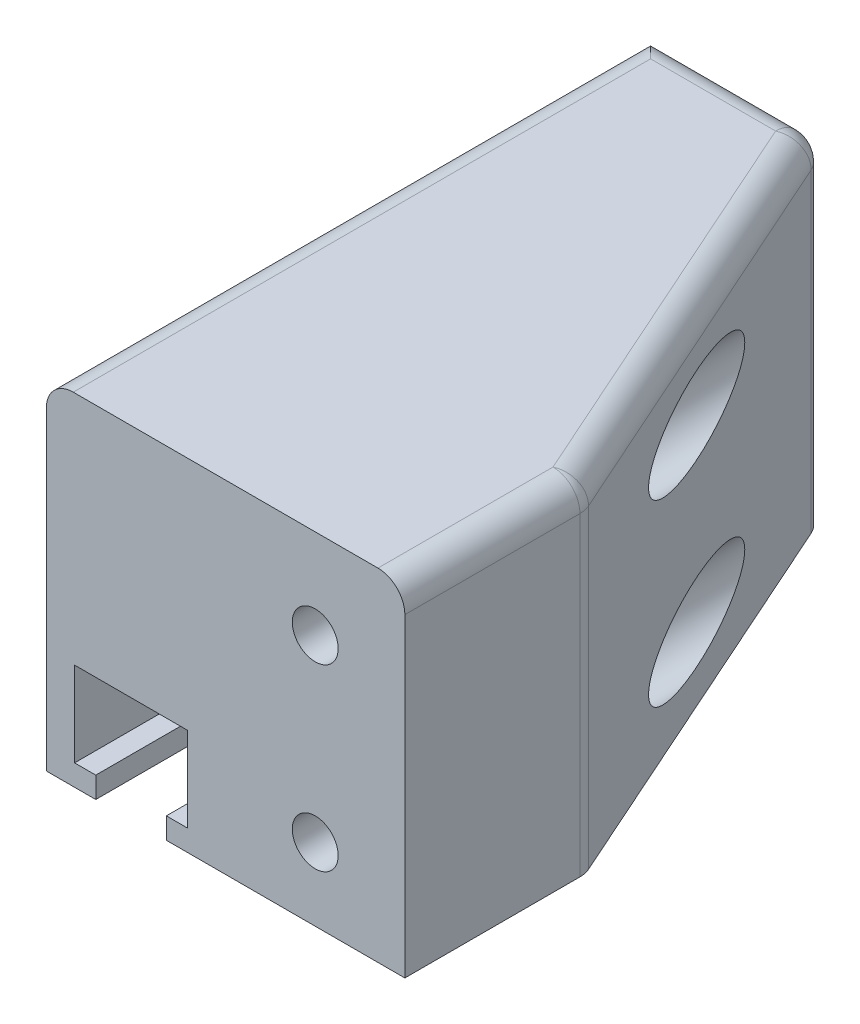
ISO-10303-21;
HEADER;
FILE_DESCRIPTION(('STEP AP214'),'2;1');
FILE_NAME('part.step','',(''),(''),'','','');
FILE_SCHEMA(('AUTOMOTIVE_DESIGN { 1 0 10303 214 1 1 1 1 }'));
ENDSEC;
DATA;
#1=APPLICATION_CONTEXT('core data for automotive mechanical design processes');
#2=APPLICATION_PROTOCOL_DEFINITION('international standard','automotive_design',2000,#1);
#3=PRODUCT_CONTEXT('',#1,'mechanical');
#4=PRODUCT('Part','Part','',(#3));
#5=PRODUCT_RELATED_PRODUCT_CATEGORY('part','',(#4));
#6=PRODUCT_DEFINITION_FORMATION('','',#4);
#7=PRODUCT_DEFINITION_CONTEXT('part definition',#1,'design');
#8=PRODUCT_DEFINITION('design','',#6,#7);
#9=PRODUCT_DEFINITION_SHAPE('','',#8);
#10=(LENGTH_UNIT() NAMED_UNIT(*) SI_UNIT(.MILLI.,.METRE.));
#11=(NAMED_UNIT(*) PLANE_ANGLE_UNIT() SI_UNIT($,.RADIAN.));
#12=(NAMED_UNIT(*) SI_UNIT($,.STERADIAN.) SOLID_ANGLE_UNIT());
#13=UNCERTAINTY_MEASURE_WITH_UNIT(LENGTH_MEASURE(1.E-05),#10,'distance_accuracy_value','');
#14=(GEOMETRIC_REPRESENTATION_CONTEXT(3) GLOBAL_UNCERTAINTY_ASSIGNED_CONTEXT((#13)) GLOBAL_UNIT_ASSIGNED_CONTEXT((#10,
#11,#12)) REPRESENTATION_CONTEXT('',''));
#15=CARTESIAN_POINT('',(0.,0.,0.));
#16=DIRECTION('',(0.,0.,1.));
#17=DIRECTION('',(1.,0.,0.));
#18=AXIS2_PLACEMENT_3D('',#15,#16,#17);
#19=CARTESIAN_POINT('',(-41.8,40.8867513459481,-40.6));
#20=DIRECTION('',(0.,-0.866025403784439,0.5));
#21=DIRECTION('',(0.,0.5,0.866025403784439));
#22=AXIS2_PLACEMENT_3D('',#19,#20,#21);
#23=PLANE('',#22);
#24=DIRECTION('',(1.,0.,0.));
#25=VECTOR('',#24,1.);
#26=CARTESIAN_POINT('',(-41.8,40.8867513459481,-40.6));
#27=LINE('',#26,#25);
#28=CARTESIAN_POINT('',(-41.8,40.8867513459481,-40.6));
#29=VERTEX_POINT('',#28);
#30=CARTESIAN_POINT('',(-35.8,40.8867513459481,-40.6));
#31=VERTEX_POINT('',#30);
#32=EDGE_CURVE('E240',#29,#31,#27,.T.);
#33=ORIENTED_EDGE('',*,*,#32,.T.);
#34=DIRECTION('',(0.,0.5,0.866025403784439));
#35=VECTOR('',#34,1.);
#36=CARTESIAN_POINT('',(-35.8,40.8867513459481,-40.6));
#37=LINE('',#36,#35);
#38=CARTESIAN_POINT('',(-35.8,43.7735026918962,-35.6));
#39=VERTEX_POINT('',#38);
#40=EDGE_CURVE('E222',#31,#39,#37,.T.);
#41=ORIENTED_EDGE('',*,*,#40,.T.);
#42=DIRECTION('',(1.,0.,0.));
#43=VECTOR('',#42,1.);
#44=CARTESIAN_POINT('',(-41.8,43.7735026918962,-35.6));
#45=LINE('',#44,#43);
#46=CARTESIAN_POINT('',(-41.8,43.7735026918962,-35.6));
#47=VERTEX_POINT('',#46);
#48=EDGE_CURVE('E245',#47,#39,#45,.T.);
#49=ORIENTED_EDGE('',*,*,#48,.F.);
#50=DIRECTION('',(0.,0.5,0.866025403784439));
#51=VECTOR('',#50,1.);
#52=CARTESIAN_POINT('',(-41.8,40.8867513459481,-40.6));
#53=LINE('',#52,#51);
#54=EDGE_CURVE('E224',#29,#47,#53,.T.);
#55=ORIENTED_EDGE('',*,*,#54,.F.);
#56=EDGE_LOOP('',(#33,#41,#49,#55));
#57=FACE_BOUND('',#56,.T.);
#58=ADVANCED_FACE('F45',(#57),#23,.T.);
#59=CARTESIAN_POINT('',(-41.8,43.7735026918962,-35.6));
#60=DIRECTION('',(0.,-0.866025403784439,-0.5));
#61=DIRECTION('',(0.,-0.5,0.866025403784439));
#62=AXIS2_PLACEMENT_3D('',#59,#60,#61);
#63=PLANE('',#62);
#64=ORIENTED_EDGE('',*,*,#48,.T.);
#65=DIRECTION('',(0.,-0.5,0.866025403784439));
#66=VECTOR('',#65,1.);
#67=CARTESIAN_POINT('',(-35.8,43.7735026918962,-35.6));
#68=LINE('',#67,#66);
#69=CARTESIAN_POINT('',(-35.8,40.8867513459481,-30.6));
#70=VERTEX_POINT('',#69);
#71=EDGE_CURVE('E230',#39,#70,#68,.T.);
#72=ORIENTED_EDGE('',*,*,#71,.T.);
#73=DIRECTION('',(1.,0.,0.));
#74=VECTOR('',#73,1.);
#75=CARTESIAN_POINT('',(-41.8,40.8867513459481,-30.6));
#76=LINE('',#75,#74);
#77=CARTESIAN_POINT('',(-41.8,40.8867513459481,-30.6));
#78=VERTEX_POINT('',#77);
#79=EDGE_CURVE('E242',#78,#70,#76,.T.);
#80=ORIENTED_EDGE('',*,*,#79,.F.);
#81=DIRECTION('',(0.,-0.5,0.866025403784439));
#82=VECTOR('',#81,1.);
#83=CARTESIAN_POINT('',(-41.8,43.7735026918962,-35.6));
#84=LINE('',#83,#82);
#85=EDGE_CURVE('E228',#47,#78,#84,.T.);
#86=ORIENTED_EDGE('',*,*,#85,.F.);
#87=EDGE_LOOP('',(#64,#72,#80,#86));
#88=FACE_BOUND('',#87,.T.);
#89=ADVANCED_FACE('F416',(#88),#63,.T.);
#90=CARTESIAN_POINT('',(-41.8,40.8867513459481,-30.6));
#91=DIRECTION('',(0.,0.,-1.));
#92=DIRECTION('',(1.,0.,0.));
#93=AXIS2_PLACEMENT_3D('',#90,#91,#92);
#94=PLANE('',#93);
#95=ORIENTED_EDGE('',*,*,#79,.T.);
#96=DIRECTION('',(0.,-1.,0.));
#97=VECTOR('',#96,1.);
#98=CARTESIAN_POINT('',(-35.8,40.8867513459481,-30.6));
#99=LINE('',#98,#97);
#100=CARTESIAN_POINT('',(-35.8,15.,-30.6));
#101=VERTEX_POINT('',#100);
#102=EDGE_CURVE('E225',#70,#101,#99,.T.);
#103=ORIENTED_EDGE('',*,*,#102,.T.);
#104=DIRECTION('',(1.,0.,0.));
#105=VECTOR('',#104,1.);
#106=CARTESIAN_POINT('',(-41.8,15.,-30.6));
#107=LINE('',#106,#105);
#108=CARTESIAN_POINT('',(-41.8,15.,-30.6));
#109=VERTEX_POINT('',#108);
#110=EDGE_CURVE('E206',#109,#101,#107,.T.);
#111=ORIENTED_EDGE('',*,*,#110,.F.);
#112=DIRECTION('',(0.,-1.,0.));
#113=VECTOR('',#112,1.);
#114=CARTESIAN_POINT('',(-41.8,40.8867513459481,-30.6));
#115=LINE('',#114,#113);
#116=EDGE_CURVE('E236',#78,#109,#115,.T.);
#117=ORIENTED_EDGE('',*,*,#116,.F.);
#118=EDGE_LOOP('',(#95,#103,#111,#117));
#119=FACE_BOUND('',#118,.T.);
#120=ADVANCED_FACE('F419',(#119),#94,.T.);
#121=CARTESIAN_POINT('',(-41.8,35.1132486540519,-40.6));
#122=DIRECTION('',(0.,0.,1.));
#123=DIRECTION('',(-1.,0.,0.));
#124=AXIS2_PLACEMENT_3D('',#121,#122,#123);
#125=PLANE('',#124);
#126=DIRECTION('',(0.,1.,0.));
#127=VECTOR('',#126,1.);
#128=CARTESIAN_POINT('',(-35.8,35.1132486540519,-40.6));
#129=LINE('',#128,#127);
#130=CARTESIAN_POINT('',(-35.8,15.,-40.6));
#131=VERTEX_POINT('',#130);
#132=EDGE_CURVE('E215',#131,#31,#129,.T.);
#133=ORIENTED_EDGE('',*,*,#132,.T.);
#134=ORIENTED_EDGE('',*,*,#32,.F.);
#135=DIRECTION('',(0.,1.,0.));
#136=VECTOR('',#135,1.);
#137=CARTESIAN_POINT('',(-41.8,35.1132486540519,-40.6));
#138=LINE('',#137,#136);
#139=CARTESIAN_POINT('',(-41.8,15.,-40.6));
#140=VERTEX_POINT('',#139);
#141=EDGE_CURVE('E217',#140,#29,#138,.T.);
#142=ORIENTED_EDGE('',*,*,#141,.F.);
#143=DIRECTION('',(-1.,0.,0.));
#144=VECTOR('',#143,1.);
#145=CARTESIAN_POINT('',(-41.8,15.,-40.6));
#146=LINE('',#145,#144);
#147=EDGE_CURVE('E203',#131,#140,#146,.T.);
#148=ORIENTED_EDGE('',*,*,#147,.F.);
#149=EDGE_LOOP('',(#133,#134,#142,#148));
#150=FACE_BOUND('',#149,.T.);
#151=ADVANCED_FACE('F213',(#150),#125,.T.);
#152=CARTESIAN_POINT('',(-41.8,0.,0.));
#153=DIRECTION('',(-1.,0.,0.));
#154=DIRECTION('',(0.,0.,-1.));
#155=AXIS2_PLACEMENT_3D('',#152,#153,#154);
#156=PLANE('',#155);
#157=CARTESIAN_POINT('',(-41.8,38.,-35.6));
#158=DIRECTION('',(1.,0.,0.));
#159=DIRECTION('',(0.,0.,-1.));
#160=AXIS2_PLACEMENT_3D('',#157,#158,#159);
#161=CIRCLE('',#160,3.25);
#162=CARTESIAN_POINT('',(-41.8,38.,-38.85));
#163=VERTEX_POINT('',#162);
#164=EDGE_CURVE('E210',#163,#163,#161,.F.);
#165=ORIENTED_EDGE('',*,*,#164,.T.);
#166=EDGE_LOOP('',(#165));
#167=FACE_BOUND('',#166,.T.);
#168=ORIENTED_EDGE('',*,*,#141,.T.);
#169=ORIENTED_EDGE('',*,*,#54,.T.);
#170=ORIENTED_EDGE('',*,*,#85,.T.);
#171=ORIENTED_EDGE('',*,*,#116,.T.);
#172=DIRECTION('',(0.,0.,1.));
#173=VECTOR('',#172,1.);
#174=CARTESIAN_POINT('',(-41.8,15.,-40.6));
#175=LINE('',#174,#173);
#176=EDGE_CURVE('E218',#140,#109,#175,.T.);
#177=ORIENTED_EDGE('',*,*,#176,.F.);
#178=EDGE_LOOP('',(#168,#169,#170,#171,#177));
#179=FACE_BOUND('',#178,.T.);
#180=ADVANCED_FACE('F421',(#167,#179),#156,.F.);
#181=CARTESIAN_POINT('',(-35.8,0.,0.));
#182=DIRECTION('',(-1.,0.,0.));
#183=DIRECTION('',(0.,0.,-1.));
#184=AXIS2_PLACEMENT_3D('',#181,#182,#183);
#185=PLANE('',#184);
#186=DIRECTION('',(0.,0.,-1.));
#187=VECTOR('',#186,1.);
#188=CARTESIAN_POINT('',(-35.8,15.,-40.6));
#189=LINE('',#188,#187);
#190=EDGE_CURVE('E199',#101,#131,#189,.T.);
#191=ORIENTED_EDGE('',*,*,#190,.F.);
#192=ORIENTED_EDGE('',*,*,#102,.F.);
#193=ORIENTED_EDGE('',*,*,#71,.F.);
#194=ORIENTED_EDGE('',*,*,#40,.F.);
#195=ORIENTED_EDGE('',*,*,#132,.F.);
#196=EDGE_LOOP('',(#191,#192,#193,#194,#195));
#197=FACE_BOUND('',#196,.T.);
#198=ADVANCED_FACE('F220',(#197),#185,.T.);
#199=CARTESIAN_POINT('',(0.,0.,-85.62));
#200=DIRECTION('',(0.,1.,0.));
#201=DIRECTION('',(-1.,0.,0.));
#202=AXIS2_PLACEMENT_3D('',#199,#200,#201);
#203=PLANE('',#202);
#204=DIRECTION('',(-0.407832100404226,0.,-0.913056941203492));
#205=VECTOR('',#204,1.);
#206=CARTESIAN_POINT('',(-26.8,0.,-85.62));
#207=LINE('',#206,#205);
#208=CARTESIAN_POINT('',(-0.331253054014699,0.,-26.3616113149583));
#209=VERTEX_POINT('',#208);
#210=CARTESIAN_POINT('',(-25.7922486684679,0.,-83.3638403025401));
#211=VERTEX_POINT('',#210);
#212=EDGE_CURVE('E309',#209,#211,#207,.T.);
#213=ORIENTED_EDGE('',*,*,#212,.F.);
#214=CARTESIAN_POINT('',(-3.81,0.,-24.8077710124182));
#215=DIRECTION('',(0.,-1.,0.));
#216=DIRECTION('',(-1.,0.,0.));
#217=AXIS2_PLACEMENT_3D('',#214,#215,#216);
#218=CIRCLE('',#217,3.81);
#219=CARTESIAN_POINT('',(0.,0.,-24.8077710124182));
#220=VERTEX_POINT('',#219);
#221=EDGE_CURVE('E377',#220,#209,#218,.F.);
#222=ORIENTED_EDGE('',*,*,#221,.F.);
#223=DIRECTION('',(0.,0.,1.));
#224=VECTOR('',#223,1.);
#225=CARTESIAN_POINT('',(0.,0.,-85.62));
#226=LINE('',#225,#224);
#227=CARTESIAN_POINT('',(0.,0.,0.));
#228=VERTEX_POINT('',#227);
#229=EDGE_CURVE('E345',#220,#228,#226,.T.);
#230=ORIENTED_EDGE('',*,*,#229,.T.);
#231=DIRECTION('',(1.,0.,0.));
#232=VECTOR('',#231,1.);
#233=CARTESIAN_POINT('',(0.,0.,0.));
#234=LINE('',#233,#232);
#235=CARTESIAN_POINT('',(-33.8,0.,0.));
#236=VERTEX_POINT('',#235);
#237=EDGE_CURVE('E326',#236,#228,#234,.T.);
#238=ORIENTED_EDGE('',*,*,#237,.F.);
#239=DIRECTION('',(0.,0.,1.));
#240=VECTOR('',#239,1.);
#241=CARTESIAN_POINT('',(-33.8,0.,-70.));
#242=LINE('',#241,#240);
#243=CARTESIAN_POINT('',(-33.8,0.,-70.));
#244=VERTEX_POINT('',#243);
#245=EDGE_CURVE('E306',#244,#236,#242,.T.);
#246=ORIENTED_EDGE('',*,*,#245,.F.);
#247=DIRECTION('',(-1.,0.,0.));
#248=VECTOR('',#247,1.);
#249=CARTESIAN_POINT('',(-43.8,0.,-70.));
#250=LINE('',#249,#248);
#251=CARTESIAN_POINT('',(-43.8,0.,-70.));
#252=VERTEX_POINT('',#251);
#253=EDGE_CURVE('E267',#244,#252,#250,.T.);
#254=ORIENTED_EDGE('',*,*,#253,.T.);
#255=DIRECTION('',(0.,0.,1.));
#256=VECTOR('',#255,1.);
#257=CARTESIAN_POINT('',(-43.8,0.,-70.));
#258=LINE('',#257,#256);
#259=CARTESIAN_POINT('',(-43.8,0.,0.));
#260=VERTEX_POINT('',#259);
#261=EDGE_CURVE('E285',#252,#260,#258,.T.);
#262=ORIENTED_EDGE('',*,*,#261,.T.);
#263=CARTESIAN_POINT('',(-50.8,0.,0.));
#264=VERTEX_POINT('',#263);
#265=EDGE_CURVE('E334',#264,#260,#234,.T.);
#266=ORIENTED_EDGE('',*,*,#265,.F.);
#267=DIRECTION('',(0.,0.,1.));
#268=VECTOR('',#267,1.);
#269=CARTESIAN_POINT('',(-50.8,0.,-85.62));
#270=LINE('',#269,#268);
#271=CARTESIAN_POINT('',(-50.8,0.,-85.62));
#272=VERTEX_POINT('',#271);
#273=EDGE_CURVE('E333',#272,#264,#270,.T.);
#274=ORIENTED_EDGE('',*,*,#273,.F.);
#275=DIRECTION('',(1.,0.,0.));
#276=VECTOR('',#275,1.);
#277=CARTESIAN_POINT('',(0.,0.,-85.62));
#278=LINE('',#277,#276);
#279=CARTESIAN_POINT('',(-29.2709956144532,0.,-85.62));
#280=VERTEX_POINT('',#279);
#281=EDGE_CURVE('E327',#272,#280,#278,.T.);
#282=ORIENTED_EDGE('',*,*,#281,.T.);
#283=CARTESIAN_POINT('',(-29.2709956144532,0.,-81.81));
#284=DIRECTION('',(0.,-1.,0.));
#285=DIRECTION('',(-1.,0.,0.));
#286=AXIS2_PLACEMENT_3D('',#283,#284,#285);
#287=CIRCLE('',#286,3.81);
#288=EDGE_CURVE('E380',#211,#280,#287,.F.);
#289=ORIENTED_EDGE('',*,*,#288,.F.);
#290=EDGE_LOOP('',(#213,#222,#230,#238,#246,#254,#262,#266,#274,#282,#289));
#291=FACE_BOUND('',#290,.T.);
#292=ADVANCED_FACE('F509',(#291),#203,.F.);
#293=CARTESIAN_POINT('',(0.,0.,-85.62));
#294=DIRECTION('',(-1.,0.,0.));
#295=DIRECTION('',(0.,0.,-1.));
#296=AXIS2_PLACEMENT_3D('',#293,#294,#295);
#297=PLANE('',#296);
#298=DIRECTION('',(0.,0.,1.));
#299=VECTOR('',#298,1.);
#300=CARTESIAN_POINT('',(0.,44.59,-85.62));
#301=LINE('',#300,#299);
#302=CARTESIAN_POINT('',(0.,44.59,0.));
#303=VERTEX_POINT('',#302);
#304=CARTESIAN_POINT('',(0.,44.59,-24.8077710124182));
#305=VERTEX_POINT('',#304);
#306=EDGE_CURVE('E383',#303,#305,#301,.F.);
#307=ORIENTED_EDGE('',*,*,#306,.F.);
#308=DIRECTION('',(0.,1.,0.));
#309=VECTOR('',#308,1.);
#310=CARTESIAN_POINT('',(0.,0.,0.));
#311=LINE('',#310,#309);
#312=EDGE_CURVE('E337',#228,#303,#311,.T.);
#313=ORIENTED_EDGE('',*,*,#312,.F.);
#314=ORIENTED_EDGE('',*,*,#229,.F.);
#315=DIRECTION('',(0.,1.,0.));
#316=VECTOR('',#315,1.);
#317=CARTESIAN_POINT('',(0.,0.,-24.8077710124182));
#318=LINE('',#317,#316);
#319=EDGE_CURVE('E386',#305,#220,#318,.F.);
#320=ORIENTED_EDGE('',*,*,#319,.F.);
#321=EDGE_LOOP('',(#307,#313,#314,#320));
#322=FACE_BOUND('',#321,.T.);
#323=ADVANCED_FACE('F505',(#322),#297,.F.);
#324=CARTESIAN_POINT('',(0.,48.4,-85.62));
#325=DIRECTION('',(0.,-1.,0.));
#326=DIRECTION('',(1.,0.,0.));
#327=AXIS2_PLACEMENT_3D('',#324,#325,#326);
#328=PLANE('',#327);
#329=DIRECTION('',(-0.407832100404226,0.,-0.913056941203492));
#330=VECTOR('',#329,1.);
#331=CARTESIAN_POINT('',(-25.821182753166,48.4,-74.0865383702525));
#332=LINE('',#331,#330);
#333=CARTESIAN_POINT('',(-29.2709956144532,48.4,-81.81));
#334=VERTEX_POINT('',#333);
#335=CARTESIAN_POINT('',(-3.81,48.4,-24.8077710124182));
#336=VERTEX_POINT('',#335);
#337=EDGE_CURVE('E364',#334,#336,#332,.F.);
#338=ORIENTED_EDGE('',*,*,#337,.F.);
#339=DIRECTION('',(-1.,0.,0.));
#340=VECTOR('',#339,1.);
#341=CARTESIAN_POINT('',(0.,48.4,-81.81));
#342=LINE('',#341,#340);
#343=CARTESIAN_POINT('',(-46.99,48.4,-81.81));
#344=VERTEX_POINT('',#343);
#345=EDGE_CURVE('E361',#344,#334,#342,.F.);
#346=ORIENTED_EDGE('',*,*,#345,.F.);
#347=DIRECTION('',(0.,0.,1.));
#348=VECTOR('',#347,1.);
#349=CARTESIAN_POINT('',(-46.99,48.4,-85.62));
#350=LINE('',#349,#348);
#351=CARTESIAN_POINT('',(-46.99,48.4,0.));
#352=VERTEX_POINT('',#351);
#353=EDGE_CURVE('E358',#352,#344,#350,.F.);
#354=ORIENTED_EDGE('',*,*,#353,.F.);
#355=DIRECTION('',(-1.,0.,0.));
#356=VECTOR('',#355,1.);
#357=CARTESIAN_POINT('',(0.,48.4,0.));
#358=LINE('',#357,#356);
#359=CARTESIAN_POINT('',(-3.81,48.4,0.));
#360=VERTEX_POINT('',#359);
#361=EDGE_CURVE('E340',#360,#352,#358,.T.);
#362=ORIENTED_EDGE('',*,*,#361,.F.);
#363=DIRECTION('',(0.,0.,1.));
#364=VECTOR('',#363,1.);
#365=CARTESIAN_POINT('',(-3.81,48.4,-85.62));
#366=LINE('',#365,#364);
#367=EDGE_CURVE('E367',#336,#360,#366,.T.);
#368=ORIENTED_EDGE('',*,*,#367,.F.);
#369=EDGE_LOOP('',(#338,#346,#354,#362,#368));
#370=FACE_BOUND('',#369,.T.);
#371=ADVANCED_FACE('F502',(#370),#328,.F.);
#372=CARTESIAN_POINT('',(-50.8,0.,-85.62));
#373=DIRECTION('',(1.,0.,0.));
#374=DIRECTION('',(0.,0.,1.));
#375=AXIS2_PLACEMENT_3D('',#372,#373,#374);
#376=PLANE('',#375);
#377=CARTESIAN_POINT('',(-50.8,38.,-35.6));
#378=DIRECTION('',(1.,0.,0.));
#379=DIRECTION('',(0.,0.,-1.));
#380=AXIS2_PLACEMENT_3D('',#377,#378,#379);
#381=CIRCLE('',#380,3.25);
#382=CARTESIAN_POINT('',(-50.8,38.,-38.85));
#383=VERTEX_POINT('',#382);
#384=EDGE_CURVE('E401',#383,#383,#381,.T.);
#385=ORIENTED_EDGE('',*,*,#384,.T.);
#386=EDGE_LOOP('',(#385));
#387=FACE_BOUND('',#386,.T.);
#388=DIRECTION('',(0.,-1.,0.));
#389=VECTOR('',#388,1.);
#390=CARTESIAN_POINT('',(-50.8,0.,-85.62));
#391=LINE('',#390,#389);
#392=CARTESIAN_POINT('',(-50.8,44.59,-85.62));
#393=VERTEX_POINT('',#392);
#394=EDGE_CURVE('E330',#393,#272,#391,.T.);
#395=ORIENTED_EDGE('',*,*,#394,.T.);
#396=ORIENTED_EDGE('',*,*,#273,.T.);
#397=DIRECTION('',(0.,-1.,0.));
#398=VECTOR('',#397,1.);
#399=CARTESIAN_POINT('',(-50.8,0.,0.));
#400=LINE('',#399,#398);
#401=CARTESIAN_POINT('',(-50.8,44.59,0.));
#402=VERTEX_POINT('',#401);
#403=EDGE_CURVE('E331',#402,#264,#400,.T.);
#404=ORIENTED_EDGE('',*,*,#403,.F.);
#405=DIRECTION('',(0.,0.,1.));
#406=VECTOR('',#405,1.);
#407=CARTESIAN_POINT('',(-50.8,44.59,-85.62));
#408=LINE('',#407,#406);
#409=EDGE_CURVE('E11',#393,#402,#408,.T.);
#410=ORIENTED_EDGE('',*,*,#409,.F.);
#411=EDGE_LOOP('',(#395,#396,#404,#410));
#412=FACE_BOUND('',#411,.T.);
#413=ADVANCED_FACE('F495',(#387,#412),#376,.F.);
#414=CARTESIAN_POINT('',(0.,0.,-85.62));
#415=DIRECTION('',(0.,0.,1.));
#416=DIRECTION('',(-1.,0.,0.));
#417=AXIS2_PLACEMENT_3D('',#414,#415,#416);
#418=PLANE('',#417);
#419=DIRECTION('',(0.,1.,0.));
#420=VECTOR('',#419,1.);
#421=CARTESIAN_POINT('',(-29.2709956144532,0.,-85.62));
#422=LINE('',#421,#420);
#423=CARTESIAN_POINT('',(-29.2709956144532,44.59,-85.62));
#424=VERTEX_POINT('',#423);
#425=EDGE_CURVE('E348',#280,#424,#422,.T.);
#426=ORIENTED_EDGE('',*,*,#425,.F.);
#427=ORIENTED_EDGE('',*,*,#281,.F.);
#428=ORIENTED_EDGE('',*,*,#394,.F.);
#429=DIRECTION('',(-1.,0.,0.));
#430=VECTOR('',#429,1.);
#431=CARTESIAN_POINT('',(0.,44.59,-85.62));
#432=LINE('',#431,#430);
#433=EDGE_CURVE('E355',#424,#393,#432,.T.);
#434=ORIENTED_EDGE('',*,*,#433,.F.);
#435=EDGE_LOOP('',(#426,#427,#428,#434));
#436=FACE_BOUND('',#435,.T.);
#437=ADVANCED_FACE('F492',(#436),#418,.F.);
#438=CARTESIAN_POINT('',(0.,0.,0.));
#439=DIRECTION('',(0.,0.,1.));
#440=DIRECTION('',(-1.,0.,0.));
#441=AXIS2_PLACEMENT_3D('',#438,#439,#440);
#442=PLANE('',#441);
#443=CARTESIAN_POINT('',(-12.7,35.7,0.));
#444=DIRECTION('',(0.,0.,1.));
#445=DIRECTION('',(1.,0.,0.));
#446=AXIS2_PLACEMENT_3D('',#443,#444,#445);
#447=CIRCLE('',#446,3.25);
#448=CARTESIAN_POINT('',(-9.45,35.7,0.));
#449=VERTEX_POINT('',#448);
#450=EDGE_CURVE('E249',#449,#449,#447,.T.);
#451=ORIENTED_EDGE('',*,*,#450,.F.);
#452=EDGE_LOOP('',(#451));
#453=FACE_BOUND('',#452,.T.);
#454=CARTESIAN_POINT('',(-12.7,10.3,0.));
#455=DIRECTION('',(0.,0.,1.));
#456=DIRECTION('',(1.,0.,0.));
#457=AXIS2_PLACEMENT_3D('',#454,#455,#456);
#458=CIRCLE('',#457,3.25);
#459=CARTESIAN_POINT('',(-9.45,10.3,0.));
#460=VERTEX_POINT('',#459);
#461=EDGE_CURVE('E248',#460,#460,#458,.T.);
#462=ORIENTED_EDGE('',*,*,#461,.F.);
#463=EDGE_LOOP('',(#462));
#464=FACE_BOUND('',#463,.T.);
#465=ORIENTED_EDGE('',*,*,#361,.T.);
#466=CARTESIAN_POINT('',(-46.99,44.59,0.));
#467=DIRECTION('',(0.,0.,-1.));
#468=DIRECTION('',(-1.,0.,0.));
#469=AXIS2_PLACEMENT_3D('',#466,#467,#468);
#470=CIRCLE('',#469,3.81);
#471=EDGE_CURVE('E62',#402,#352,#470,.T.);
#472=ORIENTED_EDGE('',*,*,#471,.F.);
#473=ORIENTED_EDGE('',*,*,#403,.T.);
#474=ORIENTED_EDGE('',*,*,#265,.T.);
#475=DIRECTION('',(0.,1.,0.));
#476=VECTOR('',#475,1.);
#477=CARTESIAN_POINT('',(-43.8,0.,0.));
#478=LINE('',#477,#476);
#479=CARTESIAN_POINT('',(-43.8,2.99999999999999,0.));
#480=VERTEX_POINT('',#479);
#481=EDGE_CURVE('E286',#260,#480,#478,.T.);
#482=ORIENTED_EDGE('',*,*,#481,.T.);
#483=DIRECTION('',(-1.,0.,0.));
#484=VECTOR('',#483,1.);
#485=CARTESIAN_POINT('',(-43.8,2.99999999999999,0.));
#486=LINE('',#485,#484);
#487=CARTESIAN_POINT('',(-46.8,2.99999999999999,0.));
#488=VERTEX_POINT('',#487);
#489=EDGE_CURVE('E289',#480,#488,#486,.T.);
#490=ORIENTED_EDGE('',*,*,#489,.T.);
#491=DIRECTION('',(0.,1.,0.));
#492=VECTOR('',#491,1.);
#493=CARTESIAN_POINT('',(-46.8,2.99999999999999,0.));
#494=LINE('',#493,#492);
#495=CARTESIAN_POINT('',(-46.8,15.,0.));
#496=VERTEX_POINT('',#495);
#497=EDGE_CURVE('E293',#488,#496,#494,.T.);
#498=ORIENTED_EDGE('',*,*,#497,.T.);
#499=DIRECTION('',(1.,0.,0.));
#500=VECTOR('',#499,1.);
#501=CARTESIAN_POINT('',(-46.8,15.,0.));
#502=LINE('',#501,#500);
#503=CARTESIAN_POINT('',(-30.8,15.,0.));
#504=VERTEX_POINT('',#503);
#505=EDGE_CURVE('E296',#496,#504,#502,.T.);
#506=ORIENTED_EDGE('',*,*,#505,.T.);
#507=DIRECTION('',(0.,-1.,0.));
#508=VECTOR('',#507,1.);
#509=CARTESIAN_POINT('',(-30.8,15.,0.));
#510=LINE('',#509,#508);
#511=CARTESIAN_POINT('',(-30.8,2.99999999999999,0.));
#512=VERTEX_POINT('',#511);
#513=EDGE_CURVE('E299',#504,#512,#510,.T.);
#514=ORIENTED_EDGE('',*,*,#513,.T.);
#515=DIRECTION('',(-1.,0.,0.));
#516=VECTOR('',#515,1.);
#517=CARTESIAN_POINT('',(-30.8,2.99999999999999,0.));
#518=LINE('',#517,#516);
#519=CARTESIAN_POINT('',(-33.8,2.99999999999999,0.));
#520=VERTEX_POINT('',#519);
#521=EDGE_CURVE('E302',#512,#520,#518,.T.);
#522=ORIENTED_EDGE('',*,*,#521,.T.);
#523=DIRECTION('',(0.,-1.,0.));
#524=VECTOR('',#523,1.);
#525=CARTESIAN_POINT('',(-33.8,2.99999999999999,0.));
#526=LINE('',#525,#524);
#527=EDGE_CURVE('E271',#520,#236,#526,.T.);
#528=ORIENTED_EDGE('',*,*,#527,.T.);
#529=ORIENTED_EDGE('',*,*,#237,.T.);
#530=ORIENTED_EDGE('',*,*,#312,.T.);
#531=CARTESIAN_POINT('',(-3.81,44.59,0.));
#532=DIRECTION('',(0.,0.,-1.));
#533=DIRECTION('',(-1.,0.,0.));
#534=AXIS2_PLACEMENT_3D('',#531,#532,#533);
#535=CIRCLE('',#534,3.81);
#536=EDGE_CURVE('E54',#360,#303,#535,.T.);
#537=ORIENTED_EDGE('',*,*,#536,.F.);
#538=EDGE_LOOP('',(#465,#472,#473,#474,#482,#490,#498,#506,#514,#522,#528,#529,#530,#537));
#539=FACE_BOUND('',#538,.T.);
#540=ADVANCED_FACE('F490',(#453,#464,#539),#442,.T.);
#541=CARTESIAN_POINT('',(-26.8,0.,-85.62));
#542=DIRECTION('',(-0.913056941203492,0.,0.407832100404226));
#543=DIRECTION('',(-0.407832100404226,0.,-0.913056941203492));
#544=AXIS2_PLACEMENT_3D('',#541,#542,#543);
#545=PLANE('',#544);
#546=CARTESIAN_POINT('',(-12.7,10.3,-54.0528358208955));
#547=DIRECTION('',(0.913056941203492,0.,-0.407832100404226));
#548=DIRECTION('',(-0.407832100404226,0.,-0.913056941203492));
#549=AXIS2_PLACEMENT_3D('',#546,#547,#548);
#550=ELLIPSE('',#549,13.4859418730125,5.5);
#551=CARTESIAN_POINT('',(-18.2,10.3,-66.3662686567164));
#552=VERTEX_POINT('',#551);
#553=EDGE_CURVE('E290',#552,#552,#550,.T.);
#554=ORIENTED_EDGE('',*,*,#553,.F.);
#555=EDGE_LOOP('',(#554));
#556=FACE_BOUND('',#555,.T.);
#557=CARTESIAN_POINT('',(-12.7,35.7,-54.0528358208955));
#558=DIRECTION('',(0.913056941203492,0.,-0.407832100404226));
#559=DIRECTION('',(-0.407832100404226,0.,-0.913056941203492));
#560=AXIS2_PLACEMENT_3D('',#557,#558,#559);
#561=ELLIPSE('',#560,13.4859418730125,5.5);
#562=CARTESIAN_POINT('',(-18.2,35.7,-66.3662686567164));
#563=VERTEX_POINT('',#562);
#564=EDGE_CURVE('E264',#563,#563,#561,.T.);
#565=ORIENTED_EDGE('',*,*,#564,.F.);
#566=EDGE_LOOP('',(#565));
#567=FACE_BOUND('',#566,.T.);
#568=DIRECTION('',(-0.407832100404226,0.,-0.913056941203492));
#569=VECTOR('',#568,1.);
#570=CARTESIAN_POINT('',(-26.8,44.59,-85.62));
#571=LINE('',#570,#569);
#572=CARTESIAN_POINT('',(-0.331253054014696,44.59,-26.3616113149583));
#573=VERTEX_POINT('',#572);
#574=CARTESIAN_POINT('',(-25.7922486684679,44.59,-83.3638403025401));
#575=VERTEX_POINT('',#574);
#576=EDGE_CURVE('E370',#573,#575,#571,.T.);
#577=ORIENTED_EDGE('',*,*,#576,.F.);
#578=DIRECTION('',(0.,1.,0.));
#579=VECTOR('',#578,1.);
#580=CARTESIAN_POINT('',(-0.331253054014689,0.,-26.3616113149583));
#581=LINE('',#580,#579);
#582=EDGE_CURVE('E373',#209,#573,#581,.T.);
#583=ORIENTED_EDGE('',*,*,#582,.F.);
#584=ORIENTED_EDGE('',*,*,#212,.T.);
#585=DIRECTION('',(0.,1.,0.));
#586=VECTOR('',#585,1.);
#587=CARTESIAN_POINT('',(-25.7922486684679,0.,-83.3638403025401));
#588=LINE('',#587,#586);
#589=EDGE_CURVE('E375',#575,#211,#588,.F.);
#590=ORIENTED_EDGE('',*,*,#589,.F.);
#591=EDGE_LOOP('',(#577,#583,#584,#590));
#592=FACE_BOUND('',#591,.T.);
#593=ADVANCED_FACE('F466',(#556,#567,#592),#545,.F.);
#594=CARTESIAN_POINT('',(-33.8,2.99999999999999,-70.));
#595=DIRECTION('',(1.,0.,0.));
#596=DIRECTION('',(0.,0.,1.));
#597=AXIS2_PLACEMENT_3D('',#594,#595,#596);
#598=PLANE('',#597);
#599=ORIENTED_EDGE('',*,*,#527,.F.);
#600=DIRECTION('',(0.,0.,1.));
#601=VECTOR('',#600,1.);
#602=CARTESIAN_POINT('',(-33.8,2.99999999999999,-70.));
#603=LINE('',#602,#601);
#604=CARTESIAN_POINT('',(-33.8,2.99999999999999,-70.));
#605=VERTEX_POINT('',#604);
#606=EDGE_CURVE('E310',#605,#520,#603,.T.);
#607=ORIENTED_EDGE('',*,*,#606,.F.);
#608=DIRECTION('',(0.,-1.,0.));
#609=VECTOR('',#608,1.);
#610=CARTESIAN_POINT('',(-33.8,2.99999999999999,-70.));
#611=LINE('',#610,#609);
#612=EDGE_CURVE('E283',#605,#244,#611,.T.);
#613=ORIENTED_EDGE('',*,*,#612,.T.);
#614=ORIENTED_EDGE('',*,*,#245,.T.);
#615=EDGE_LOOP('',(#599,#607,#613,#614));
#616=FACE_BOUND('',#615,.T.);
#617=ADVANCED_FACE('F462',(#616),#598,.F.);
#618=CARTESIAN_POINT('',(-30.8,2.99999999999999,-70.));
#619=DIRECTION('',(0.,-1.,0.));
#620=DIRECTION('',(0.,0.,1.));
#621=AXIS2_PLACEMENT_3D('',#618,#619,#620);
#622=PLANE('',#621);
#623=ORIENTED_EDGE('',*,*,#521,.F.);
#624=DIRECTION('',(0.,0.,1.));
#625=VECTOR('',#624,1.);
#626=CARTESIAN_POINT('',(-30.8,2.99999999999999,-70.));
#627=LINE('',#626,#625);
#628=CARTESIAN_POINT('',(-30.8,2.99999999999999,-70.));
#629=VERTEX_POINT('',#628);
#630=EDGE_CURVE('E312',#629,#512,#627,.T.);
#631=ORIENTED_EDGE('',*,*,#630,.F.);
#632=DIRECTION('',(-1.,0.,0.));
#633=VECTOR('',#632,1.);
#634=CARTESIAN_POINT('',(-30.8,2.99999999999999,-70.));
#635=LINE('',#634,#633);
#636=EDGE_CURVE('E281',#629,#605,#635,.T.);
#637=ORIENTED_EDGE('',*,*,#636,.T.);
#638=ORIENTED_EDGE('',*,*,#606,.T.);
#639=EDGE_LOOP('',(#623,#631,#637,#638));
#640=FACE_BOUND('',#639,.T.);
#641=ADVANCED_FACE('F465',(#640),#622,.F.);
#642=CARTESIAN_POINT('',(-30.8,15.,-70.));
#643=DIRECTION('',(1.,0.,0.));
#644=DIRECTION('',(0.,1.,0.));
#645=AXIS2_PLACEMENT_3D('',#642,#643,#644);
#646=PLANE('',#645);
#647=ORIENTED_EDGE('',*,*,#513,.F.);
#648=DIRECTION('',(0.,0.,1.));
#649=VECTOR('',#648,1.);
#650=CARTESIAN_POINT('',(-30.8,15.,-70.));
#651=LINE('',#650,#649);
#652=CARTESIAN_POINT('',(-30.8,15.,-70.));
#653=VERTEX_POINT('',#652);
#654=EDGE_CURVE('E314',#653,#504,#651,.T.);
#655=ORIENTED_EDGE('',*,*,#654,.F.);
#656=DIRECTION('',(0.,-1.,0.));
#657=VECTOR('',#656,1.);
#658=CARTESIAN_POINT('',(-30.8,15.,-70.));
#659=LINE('',#658,#657);
#660=EDGE_CURVE('E279',#653,#629,#659,.T.);
#661=ORIENTED_EDGE('',*,*,#660,.T.);
#662=ORIENTED_EDGE('',*,*,#630,.T.);
#663=EDGE_LOOP('',(#647,#655,#661,#662));
#664=FACE_BOUND('',#663,.T.);
#665=ADVANCED_FACE('F470',(#664),#646,.F.);
#666=CARTESIAN_POINT('',(-46.8,15.,-70.));
#667=DIRECTION('',(0.,1.,0.));
#668=DIRECTION('',(0.,0.,-1.));
#669=AXIS2_PLACEMENT_3D('',#666,#667,#668);
#670=PLANE('',#669);
#671=ORIENTED_EDGE('',*,*,#176,.T.);
#672=ORIENTED_EDGE('',*,*,#110,.T.);
#673=ORIENTED_EDGE('',*,*,#190,.T.);
#674=ORIENTED_EDGE('',*,*,#147,.T.);
#675=EDGE_LOOP('',(#671,#672,#673,#674));
#676=FACE_BOUND('',#675,.T.);
#677=ORIENTED_EDGE('',*,*,#505,.F.);
#678=DIRECTION('',(0.,0.,1.));
#679=VECTOR('',#678,1.);
#680=CARTESIAN_POINT('',(-46.8,15.,-70.));
#681=LINE('',#680,#679);
#682=CARTESIAN_POINT('',(-46.8,15.,-70.));
#683=VERTEX_POINT('',#682);
#684=EDGE_CURVE('E316',#683,#496,#681,.T.);
#685=ORIENTED_EDGE('',*,*,#684,.F.);
#686=DIRECTION('',(1.,0.,0.));
#687=VECTOR('',#686,1.);
#688=CARTESIAN_POINT('',(-46.8,15.,-70.));
#689=LINE('',#688,#687);
#690=EDGE_CURVE('E277',#683,#653,#689,.T.);
#691=ORIENTED_EDGE('',*,*,#690,.T.);
#692=ORIENTED_EDGE('',*,*,#654,.T.);
#693=EDGE_LOOP('',(#677,#685,#691,#692));
#694=FACE_BOUND('',#693,.T.);
#695=ADVANCED_FACE('F201',(#676,#694),#670,.F.);
#696=CARTESIAN_POINT('',(-46.8,2.99999999999999,-70.));
#697=DIRECTION('',(-1.,0.,0.));
#698=DIRECTION('',(0.,-1.,0.));
#699=AXIS2_PLACEMENT_3D('',#696,#697,#698);
#700=PLANE('',#699);
#701=ORIENTED_EDGE('',*,*,#497,.F.);
#702=DIRECTION('',(0.,0.,1.));
#703=VECTOR('',#702,1.);
#704=CARTESIAN_POINT('',(-46.8,2.99999999999999,-70.));
#705=LINE('',#704,#703);
#706=CARTESIAN_POINT('',(-46.8,2.99999999999999,-70.));
#707=VERTEX_POINT('',#706);
#708=EDGE_CURVE('E318',#707,#488,#705,.T.);
#709=ORIENTED_EDGE('',*,*,#708,.F.);
#710=DIRECTION('',(0.,1.,0.));
#711=VECTOR('',#710,1.);
#712=CARTESIAN_POINT('',(-46.8,2.99999999999999,-70.));
#713=LINE('',#712,#711);
#714=EDGE_CURVE('E275',#707,#683,#713,.T.);
#715=ORIENTED_EDGE('',*,*,#714,.T.);
#716=ORIENTED_EDGE('',*,*,#684,.T.);
#717=EDGE_LOOP('',(#701,#709,#715,#716));
#718=FACE_BOUND('',#717,.T.);
#719=ADVANCED_FACE('F477',(#718),#700,.F.);
#720=CARTESIAN_POINT('',(-43.8,2.99999999999999,-70.));
#721=DIRECTION('',(0.,-1.,0.));
#722=DIRECTION('',(0.,0.,1.));
#723=AXIS2_PLACEMENT_3D('',#720,#721,#722);
#724=PLANE('',#723);
#725=ORIENTED_EDGE('',*,*,#489,.F.);
#726=DIRECTION('',(0.,0.,1.));
#727=VECTOR('',#726,1.);
#728=CARTESIAN_POINT('',(-43.8,2.99999999999999,-70.));
#729=LINE('',#728,#727);
#730=CARTESIAN_POINT('',(-43.8,2.99999999999999,-70.));
#731=VERTEX_POINT('',#730);
#732=EDGE_CURVE('E320',#731,#480,#729,.T.);
#733=ORIENTED_EDGE('',*,*,#732,.F.);
#734=DIRECTION('',(-1.,0.,0.));
#735=VECTOR('',#734,1.);
#736=CARTESIAN_POINT('',(-43.8,2.99999999999999,-70.));
#737=LINE('',#736,#735);
#738=EDGE_CURVE('E273',#731,#707,#737,.T.);
#739=ORIENTED_EDGE('',*,*,#738,.T.);
#740=ORIENTED_EDGE('',*,*,#708,.T.);
#741=EDGE_LOOP('',(#725,#733,#739,#740));
#742=FACE_BOUND('',#741,.T.);
#743=ADVANCED_FACE('F480',(#742),#724,.F.);
#744=CARTESIAN_POINT('',(-43.8,0.,-70.));
#745=DIRECTION('',(-1.,0.,0.));
#746=DIRECTION('',(0.,0.,-1.));
#747=AXIS2_PLACEMENT_3D('',#744,#745,#746);
#748=PLANE('',#747);
#749=ORIENTED_EDGE('',*,*,#481,.F.);
#750=ORIENTED_EDGE('',*,*,#261,.F.);
#751=DIRECTION('',(0.,1.,0.));
#752=VECTOR('',#751,1.);
#753=CARTESIAN_POINT('',(-43.8,0.,-70.));
#754=LINE('',#753,#752);
#755=EDGE_CURVE('E270',#252,#731,#754,.T.);
#756=ORIENTED_EDGE('',*,*,#755,.T.);
#757=ORIENTED_EDGE('',*,*,#732,.T.);
#758=EDGE_LOOP('',(#749,#750,#756,#757));
#759=FACE_BOUND('',#758,.T.);
#760=ADVANCED_FACE('F460',(#759),#748,.F.);
#761=CARTESIAN_POINT('',(0.,0.,-70.));
#762=DIRECTION('',(0.,0.,1.));
#763=DIRECTION('',(-1.,0.,0.));
#764=AXIS2_PLACEMENT_3D('',#761,#762,#763);
#765=PLANE('',#764);
#766=ORIENTED_EDGE('',*,*,#253,.F.);
#767=ORIENTED_EDGE('',*,*,#612,.F.);
#768=ORIENTED_EDGE('',*,*,#636,.F.);
#769=ORIENTED_EDGE('',*,*,#660,.F.);
#770=ORIENTED_EDGE('',*,*,#690,.F.);
#771=ORIENTED_EDGE('',*,*,#714,.F.);
#772=ORIENTED_EDGE('',*,*,#738,.F.);
#773=ORIENTED_EDGE('',*,*,#755,.F.);
#774=EDGE_LOOP('',(#766,#767,#768,#769,#770,#771,#772,#773));
#775=FACE_BOUND('',#774,.T.);
#776=ADVANCED_FACE('F453',(#775),#765,.T.);
#777=CARTESIAN_POINT('',(-12.7,35.7,-5.62));
#778=DIRECTION('',(0.,0.,-1.));
#779=DIRECTION('',(1.,0.,0.));
#780=AXIS2_PLACEMENT_3D('',#777,#778,#779);
#781=CYLINDRICAL_SURFACE('',#780,5.5);
#782=CARTESIAN_POINT('',(-12.7,35.7,-5.62));
#783=DIRECTION('',(0.,0.,1.));
#784=DIRECTION('',(1.,0.,0.));
#785=AXIS2_PLACEMENT_3D('',#782,#783,#784);
#786=CIRCLE('',#785,5.5);
#787=CARTESIAN_POINT('',(-7.2,35.7,-5.62));
#788=VERTEX_POINT('',#787);
#789=EDGE_CURVE('E252',#788,#788,#786,.T.);
#790=ORIENTED_EDGE('',*,*,#789,.T.);
#791=EDGE_LOOP('',(#790));
#792=FACE_BOUND('',#791,.T.);
#793=ORIENTED_EDGE('',*,*,#564,.T.);
#794=EDGE_LOOP('',(#793));
#795=FACE_BOUND('',#794,.T.);
#796=ADVANCED_FACE('F450',(#792,#795),#781,.F.);
#797=CARTESIAN_POINT('',(-12.7,35.7,-5.62));
#798=DIRECTION('',(0.,0.,-1.));
#799=DIRECTION('',(1.,0.,0.));
#800=AXIS2_PLACEMENT_3D('',#797,#798,#799);
#801=PLANE('',#800);
#802=CARTESIAN_POINT('',(-12.7,35.7,-5.62));
#803=DIRECTION('',(0.,0.,1.));
#804=DIRECTION('',(1.,0.,0.));
#805=AXIS2_PLACEMENT_3D('',#802,#803,#804);
#806=CIRCLE('',#805,3.25);
#807=CARTESIAN_POINT('',(-9.45,35.7,-5.62));
#808=VERTEX_POINT('',#807);
#809=EDGE_CURVE('E253',#808,#808,#806,.T.);
#810=ORIENTED_EDGE('',*,*,#809,.T.);
#811=EDGE_LOOP('',(#810));
#812=FACE_BOUND('',#811,.T.);
#813=ORIENTED_EDGE('',*,*,#789,.F.);
#814=EDGE_LOOP('',(#813));
#815=FACE_BOUND('',#814,.T.);
#816=ADVANCED_FACE('F448',(#812,#815),#801,.T.);
#817=CARTESIAN_POINT('',(-12.7,10.3,-5.62));
#818=DIRECTION('',(0.,0.,-1.));
#819=DIRECTION('',(1.,0.,0.));
#820=AXIS2_PLACEMENT_3D('',#817,#818,#819);
#821=CYLINDRICAL_SURFACE('',#820,5.5);
#822=CARTESIAN_POINT('',(-12.7,10.3,-5.62));
#823=DIRECTION('',(0.,0.,1.));
#824=DIRECTION('',(1.,0.,0.));
#825=AXIS2_PLACEMENT_3D('',#822,#823,#824);
#826=CIRCLE('',#825,5.5);
#827=CARTESIAN_POINT('',(-7.19999999999999,10.3,-5.62));
#828=VERTEX_POINT('',#827);
#829=EDGE_CURVE('E261',#828,#828,#826,.T.);
#830=ORIENTED_EDGE('',*,*,#829,.T.);
#831=EDGE_LOOP('',(#830));
#832=FACE_BOUND('',#831,.T.);
#833=ORIENTED_EDGE('',*,*,#553,.T.);
#834=EDGE_LOOP('',(#833));
#835=FACE_BOUND('',#834,.T.);
#836=ADVANCED_FACE('F444',(#832,#835),#821,.F.);
#837=CARTESIAN_POINT('',(-12.7,10.3,-5.62));
#838=DIRECTION('',(0.,0.,-1.));
#839=DIRECTION('',(1.,0.,0.));
#840=AXIS2_PLACEMENT_3D('',#837,#838,#839);
#841=PLANE('',#840);
#842=CARTESIAN_POINT('',(-12.7,10.3,-5.62));
#843=DIRECTION('',(0.,0.,1.));
#844=DIRECTION('',(1.,0.,0.));
#845=AXIS2_PLACEMENT_3D('',#842,#843,#844);
#846=CIRCLE('',#845,3.25);
#847=CARTESIAN_POINT('',(-9.45,10.3,-5.62));
#848=VERTEX_POINT('',#847);
#849=EDGE_CURVE('E256',#848,#848,#846,.T.);
#850=ORIENTED_EDGE('',*,*,#849,.T.);
#851=EDGE_LOOP('',(#850));
#852=FACE_BOUND('',#851,.T.);
#853=ORIENTED_EDGE('',*,*,#829,.F.);
#854=EDGE_LOOP('',(#853));
#855=FACE_BOUND('',#854,.T.);
#856=ADVANCED_FACE('F440',(#852,#855),#841,.T.);
#857=CARTESIAN_POINT('',(-12.7,10.3,0.));
#858=DIRECTION('',(0.,0.,-1.));
#859=DIRECTION('',(1.,0.,0.));
#860=AXIS2_PLACEMENT_3D('',#857,#858,#859);
#861=CYLINDRICAL_SURFACE('',#860,3.25);
#862=ORIENTED_EDGE('',*,*,#461,.T.);
#863=EDGE_LOOP('',(#862));
#864=FACE_BOUND('',#863,.T.);
#865=ORIENTED_EDGE('',*,*,#849,.F.);
#866=EDGE_LOOP('',(#865));
#867=FACE_BOUND('',#866,.T.);
#868=ADVANCED_FACE('F436',(#864,#867),#861,.F.);
#869=CARTESIAN_POINT('',(-12.7,35.7,0.));
#870=DIRECTION('',(0.,0.,-1.));
#871=DIRECTION('',(1.,0.,0.));
#872=AXIS2_PLACEMENT_3D('',#869,#870,#871);
#873=CYLINDRICAL_SURFACE('',#872,3.25);
#874=ORIENTED_EDGE('',*,*,#450,.T.);
#875=EDGE_LOOP('',(#874));
#876=FACE_BOUND('',#875,.T.);
#877=ORIENTED_EDGE('',*,*,#809,.F.);
#878=EDGE_LOOP('',(#877));
#879=FACE_BOUND('',#878,.T.);
#880=ADVANCED_FACE('F432',(#876,#879),#873,.F.);
#881=CARTESIAN_POINT('',(0.00100000000001488,38.,-35.6));
#882=DIRECTION('',(-1.,0.,0.));
#883=DIRECTION('',(0.,0.,-1.));
#884=AXIS2_PLACEMENT_3D('',#881,#882,#883);
#885=CYLINDRICAL_SURFACE('',#884,3.25);
#886=CARTESIAN_POINT('',(-50.8,38.,-38.85));
#887=CARTESIAN_POINT('',(-50.70625,38.,-38.85));
#888=CARTESIAN_POINT('',(-50.6125,38.,-38.85));
#889=CARTESIAN_POINT('',(-50.425,38.,-38.85));
#890=CARTESIAN_POINT('',(-50.33125,38.,-38.85));
#891=CARTESIAN_POINT('',(-50.14375,38.,-38.85));
#892=CARTESIAN_POINT('',(-50.05,38.,-38.85));
#893=CARTESIAN_POINT('',(-49.8625,38.,-38.85));
#894=CARTESIAN_POINT('',(-49.76875,38.,-38.85));
#895=CARTESIAN_POINT('',(-49.58125,38.,-38.85));
#896=CARTESIAN_POINT('',(-49.4875,38.,-38.85));
#897=CARTESIAN_POINT('',(-49.3,38.,-38.85));
#898=CARTESIAN_POINT('',(-49.20625,38.,-38.85));
#899=CARTESIAN_POINT('',(-49.01875,38.,-38.85));
#900=CARTESIAN_POINT('',(-48.925,38.,-38.85));
#901=CARTESIAN_POINT('',(-48.7375,38.,-38.85));
#902=CARTESIAN_POINT('',(-48.64375,38.,-38.85));
#903=CARTESIAN_POINT('',(-48.45625,38.,-38.85));
#904=CARTESIAN_POINT('',(-48.3625,38.,-38.85));
#905=CARTESIAN_POINT('',(-48.175,38.,-38.85));
#906=CARTESIAN_POINT('',(-48.08125,38.,-38.85));
#907=CARTESIAN_POINT('',(-47.89375,38.,-38.85));
#908=CARTESIAN_POINT('',(-47.8,38.,-38.85));
#909=CARTESIAN_POINT('',(-47.6125,38.,-38.85));
#910=CARTESIAN_POINT('',(-47.51875,38.,-38.85));
#911=CARTESIAN_POINT('',(-47.33125,38.,-38.85));
#912=CARTESIAN_POINT('',(-47.2375,38.,-38.85));
#913=CARTESIAN_POINT('',(-47.05,38.,-38.85));
#914=CARTESIAN_POINT('',(-46.95625,38.,-38.85));
#915=CARTESIAN_POINT('',(-46.76875,38.,-38.85));
#916=CARTESIAN_POINT('',(-46.675,38.,-38.85));
#917=CARTESIAN_POINT('',(-46.4875,38.,-38.85));
#918=CARTESIAN_POINT('',(-46.39375,38.,-38.85));
#919=CARTESIAN_POINT('',(-46.20625,38.,-38.85));
#920=CARTESIAN_POINT('',(-46.1125,38.,-38.85));
#921=CARTESIAN_POINT('',(-45.925,38.,-38.85));
#922=CARTESIAN_POINT('',(-45.83125,38.,-38.85));
#923=CARTESIAN_POINT('',(-45.64375,38.,-38.85));
#924=CARTESIAN_POINT('',(-45.55,38.,-38.85));
#925=CARTESIAN_POINT('',(-45.3625,38.,-38.85));
#926=CARTESIAN_POINT('',(-45.26875,38.,-38.85));
#927=CARTESIAN_POINT('',(-45.08125,38.,-38.85));
#928=CARTESIAN_POINT('',(-44.9875,38.,-38.85));
#929=CARTESIAN_POINT('',(-44.8,38.,-38.85));
#930=CARTESIAN_POINT('',(-44.70625,38.,-38.85));
#931=CARTESIAN_POINT('',(-44.51875,38.,-38.85));
#932=CARTESIAN_POINT('',(-44.425,38.,-38.85));
#933=CARTESIAN_POINT('',(-44.2375,38.,-38.85));
#934=CARTESIAN_POINT('',(-44.14375,38.,-38.85));
#935=CARTESIAN_POINT('',(-43.95625,38.,-38.85));
#936=CARTESIAN_POINT('',(-43.8625,38.,-38.85));
#937=CARTESIAN_POINT('',(-43.675,38.,-38.85));
#938=CARTESIAN_POINT('',(-43.58125,38.,-38.85));
#939=CARTESIAN_POINT('',(-43.39375,38.,-38.85));
#940=CARTESIAN_POINT('',(-43.3,38.,-38.85));
#941=CARTESIAN_POINT('',(-43.1125,38.,-38.85));
#942=CARTESIAN_POINT('',(-43.01875,38.,-38.85));
#943=CARTESIAN_POINT('',(-42.83125,38.,-38.85));
#944=CARTESIAN_POINT('',(-42.7375,38.,-38.85));
#945=CARTESIAN_POINT('',(-42.55,38.,-38.85));
#946=CARTESIAN_POINT('',(-42.45625,38.,-38.85));
#947=CARTESIAN_POINT('',(-42.26875,38.,-38.85));
#948=CARTESIAN_POINT('',(-42.175,38.,-38.85));
#949=CARTESIAN_POINT('',(-41.9875,38.,-38.85));
#950=CARTESIAN_POINT('',(-41.89375,38.,-38.85));
#951=CARTESIAN_POINT('',(-41.8,38.,-38.85));
#952=B_SPLINE_CURVE_WITH_KNOTS('',3,(#886,#887,#888,#889,#890,#891,#892,#893,#894,#895,#896,
#897,#898,#899,#900,#901,#902,#903,#904,#905,#906,#907,#908,#909,#910,#911,#912,#913,#914,#915,
#916,#917,#918,#919,#920,#921,#922,#923,#924,#925,#926,#927,#928,#929,#930,#931,#932,#933,#934,
#935,#936,#937,#938,#939,#940,#941,#942,#943,#944,#945,#946,#947,#948,#949,#950,#951),
.UNSPECIFIED.,.F.,.F.,(4,2,2,2,2,2,2,2,2,2,2,2,2,2,2,2,2,2,2,2,2,2,2,2,2,2,2,2,2,2,2,2,4),(0.,
0.281249999999997,0.5625,0.843749999999997,1.125,1.40625,1.6875,1.96875,2.25,2.53125,2.8125,
3.09375,3.375,3.65625,3.9375,4.21874999999999,4.5,4.78125,5.0625,5.34374999999999,5.625,
5.90624999999999,6.1875,6.46875,6.74999999999999,7.03125,7.31249999999999,7.59375,
7.87499999999999,8.15625,8.43749999999999,8.71875,8.99999999999999),.UNSPECIFIED.);
#953=EDGE_CURVE('BSEAM435',#383,#163,#952,.T.);
#954=ORIENTED_EDGE('',*,*,#384,.F.);
#955=ORIENTED_EDGE('',*,*,#164,.F.);
#956=ORIENTED_EDGE('',*,*,#953,.T.);
#957=ORIENTED_EDGE('',*,*,#953,.F.);
#958=EDGE_LOOP('',(#954,#956,#955,#957));
#959=FACE_BOUND('',#958,.T.);
#960=ADVANCED_FACE('F435',(#959),#885,.F.);
#961=CARTESIAN_POINT('',(-3.81,44.59,-85.62));
#962=DIRECTION('',(0.,0.,1.));
#963=DIRECTION('',(-1.,0.,0.));
#964=AXIS2_PLACEMENT_3D('',#961,#962,#963);
#965=CYLINDRICAL_SURFACE('',#964,3.81);
#966=ORIENTED_EDGE('',*,*,#536,.T.);
#967=ORIENTED_EDGE('',*,*,#306,.T.);
#968=CARTESIAN_POINT('',(-3.81,44.59,-24.8077710124182));
#969=DIRECTION('',(0.,0.,1.));
#970=DIRECTION('',(0.,-1.,0.));
#971=AXIS2_PLACEMENT_3D('',#968,#969,#970);
#972=CIRCLE('',#971,3.81);
#973=EDGE_CURVE('E49',#305,#336,#972,.T.);
#974=ORIENTED_EDGE('',*,*,#973,.T.);
#975=ORIENTED_EDGE('',*,*,#367,.T.);
#976=EDGE_LOOP('',(#966,#967,#974,#975));
#977=FACE_BOUND('',#976,.T.);
#978=ADVANCED_FACE('F47',(#977),#965,.T.);
#979=CARTESIAN_POINT('',(-3.81,0.,-24.8077710124182));
#980=DIRECTION('',(0.,1.,0.));
#981=DIRECTION('',(0.,0.,-1.));
#982=AXIS2_PLACEMENT_3D('',#979,#980,#981);
#983=CYLINDRICAL_SURFACE('',#982,3.81);
#984=ORIENTED_EDGE('',*,*,#221,.T.);
#985=ORIENTED_EDGE('',*,*,#582,.T.);
#986=CARTESIAN_POINT('',(-3.81,44.59,-24.8077710124182));
#987=DIRECTION('',(0.,-1.,0.));
#988=DIRECTION('',(0.,0.,-1.));
#989=AXIS2_PLACEMENT_3D('',#986,#987,#988);
#990=CIRCLE('',#989,3.81);
#991=EDGE_CURVE('E69',#573,#305,#990,.T.);
#992=ORIENTED_EDGE('',*,*,#991,.T.);
#993=ORIENTED_EDGE('',*,*,#319,.T.);
#994=EDGE_LOOP('',(#984,#985,#992,#993));
#995=FACE_BOUND('',#994,.T.);
#996=ADVANCED_FACE('F536',(#995),#983,.T.);
#997=CARTESIAN_POINT('',(-3.81,44.59,-24.8077710124182));
#998=DIRECTION('',(0.,1.,0.));
#999=DIRECTION('',(0.,0.,-1.));
#1000=AXIS2_PLACEMENT_3D('',#997,#998,#999);
#1001=SPHERICAL_SURFACE('',#1000,3.81);
#1002=ORIENTED_EDGE('',*,*,#991,.F.);
#1003=CARTESIAN_POINT('',(-3.81,44.59,-24.8077710124182));
#1004=DIRECTION('',(-0.407832100404228,0.,-0.913056941203491));
#1005=DIRECTION('',(-0.913056941203491,0.,0.407832100404228));
#1006=AXIS2_PLACEMENT_3D('',#1003,#1004,#1005);
#1007=CIRCLE('',#1006,3.81);
#1008=EDGE_CURVE('E399',#573,#336,#1007,.F.);
#1009=ORIENTED_EDGE('',*,*,#1008,.T.);
#1010=ORIENTED_EDGE('',*,*,#973,.F.);
#1011=EDGE_LOOP('',(#1002,#1009,#1010));
#1012=FACE_BOUND('',#1011,.T.);
#1013=ADVANCED_FACE('F533',(#1012),#1001,.T.);
#1014=CARTESIAN_POINT('',(-30.2787469459853,44.59,-84.0661596974599));
#1015=DIRECTION('',(-0.407832100404226,0.,-0.913056941203492));
#1016=DIRECTION('',(0.913056941203492,0.,-0.407832100404226));
#1017=AXIS2_PLACEMENT_3D('',#1014,#1015,#1016);
#1018=CYLINDRICAL_SURFACE('',#1017,3.81);
#1019=ORIENTED_EDGE('',*,*,#1008,.F.);
#1020=ORIENTED_EDGE('',*,*,#576,.T.);
#1021=CARTESIAN_POINT('',(-29.2709956144532,44.59,-81.81));
#1022=DIRECTION('',(0.407832100404227,0.,0.913056941203492));
#1023=DIRECTION('',(0.913056941203492,0.,-0.407832100404227));
#1024=AXIS2_PLACEMENT_3D('',#1021,#1022,#1023);
#1025=CIRCLE('',#1024,3.81);
#1026=EDGE_CURVE('E396',#575,#334,#1025,.T.);
#1027=ORIENTED_EDGE('',*,*,#1026,.T.);
#1028=ORIENTED_EDGE('',*,*,#337,.T.);
#1029=EDGE_LOOP('',(#1019,#1020,#1027,#1028));
#1030=FACE_BOUND('',#1029,.T.);
#1031=ADVANCED_FACE('F529',(#1030),#1018,.T.);
#1032=CARTESIAN_POINT('',(-29.2709956144532,0.,-81.81));
#1033=DIRECTION('',(0.,1.,0.));
#1034=DIRECTION('',(-1.,0.,0.));
#1035=AXIS2_PLACEMENT_3D('',#1032,#1033,#1034);
#1036=CYLINDRICAL_SURFACE('',#1035,3.81);
#1037=ORIENTED_EDGE('',*,*,#288,.T.);
#1038=ORIENTED_EDGE('',*,*,#425,.T.);
#1039=CARTESIAN_POINT('',(-29.2709956144532,44.59,-81.81));
#1040=DIRECTION('',(0.,-1.,0.));
#1041=DIRECTION('',(0.,0.,-1.));
#1042=AXIS2_PLACEMENT_3D('',#1039,#1040,#1041);
#1043=CIRCLE('',#1042,3.81);
#1044=EDGE_CURVE('E394',#424,#575,#1043,.T.);
#1045=ORIENTED_EDGE('',*,*,#1044,.T.);
#1046=ORIENTED_EDGE('',*,*,#589,.T.);
#1047=EDGE_LOOP('',(#1037,#1038,#1045,#1046));
#1048=FACE_BOUND('',#1047,.T.);
#1049=ADVANCED_FACE('F525',(#1048),#1036,.T.);
#1050=CARTESIAN_POINT('',(-29.2709956144532,44.59,-81.81));
#1051=DIRECTION('',(0.,1.,0.));
#1052=DIRECTION('',(0.,0.,-1.));
#1053=AXIS2_PLACEMENT_3D('',#1050,#1051,#1052);
#1054=SPHERICAL_SURFACE('',#1053,3.81);
#1055=ORIENTED_EDGE('',*,*,#1044,.F.);
#1056=CARTESIAN_POINT('',(-29.2709956144532,44.59,-81.81));
#1057=DIRECTION('',(-1.,0.,0.));
#1058=DIRECTION('',(0.,0.,1.));
#1059=AXIS2_PLACEMENT_3D('',#1056,#1057,#1058);
#1060=CIRCLE('',#1059,3.81);
#1061=EDGE_CURVE('E392',#424,#334,#1060,.F.);
#1062=ORIENTED_EDGE('',*,*,#1061,.T.);
#1063=ORIENTED_EDGE('',*,*,#1026,.F.);
#1064=EDGE_LOOP('',(#1055,#1062,#1063));
#1065=FACE_BOUND('',#1064,.T.);
#1066=ADVANCED_FACE('F521',(#1065),#1054,.T.);
#1067=CARTESIAN_POINT('',(-46.99,44.59,-85.62));
#1068=DIRECTION('',(0.,0.,1.));
#1069=DIRECTION('',(-1.,0.,0.));
#1070=AXIS2_PLACEMENT_3D('',#1067,#1068,#1069);
#1071=CYLINDRICAL_SURFACE('',#1070,3.81);
#1072=ORIENTED_EDGE('',*,*,#471,.T.);
#1073=ORIENTED_EDGE('',*,*,#353,.T.);
#1074=CARTESIAN_POINT('',(-46.99,44.59,-81.81));
#1075=DIRECTION('',(0.707106781186547,0.,-0.707106781186547));
#1076=DIRECTION('',(0.707106781186547,0.,0.707106781186547));
#1077=AXIS2_PLACEMENT_3D('',#1074,#1075,#1076);
#1078=ELLIPSE('',#1077,5.38815367264149,3.81);
#1079=EDGE_CURVE('E390',#344,#393,#1078,.F.);
#1080=ORIENTED_EDGE('',*,*,#1079,.T.);
#1081=ORIENTED_EDGE('',*,*,#409,.T.);
#1082=EDGE_LOOP('',(#1072,#1073,#1080,#1081));
#1083=FACE_BOUND('',#1082,.T.);
#1084=ADVANCED_FACE('F517',(#1083),#1071,.T.);
#1085=CARTESIAN_POINT('',(0.,44.59,-81.81));
#1086=DIRECTION('',(-1.,0.,0.));
#1087=DIRECTION('',(0.,-1.,0.));
#1088=AXIS2_PLACEMENT_3D('',#1085,#1086,#1087);
#1089=CYLINDRICAL_SURFACE('',#1088,3.81);
#1090=ORIENTED_EDGE('',*,*,#1061,.F.);
#1091=ORIENTED_EDGE('',*,*,#433,.T.);
#1092=ORIENTED_EDGE('',*,*,#1079,.F.);
#1093=ORIENTED_EDGE('',*,*,#345,.T.);
#1094=EDGE_LOOP('',(#1090,#1091,#1092,#1093));
#1095=FACE_BOUND('',#1094,.T.);
#1096=ADVANCED_FACE('F514',(#1095),#1089,.T.);
#1097=CLOSED_SHELL('',(#58,#89,#120,#151,#180,#198,#292,#323,#371,#413,#437,#540,#593,#617,#641,
#665,#695,#719,#743,#760,#776,#796,#816,#836,#856,#868,#880,#960,#978,#996,#1013,#1031,#1049,
#1066,#1084,#1096));
#1098=MANIFOLD_SOLID_BREP('B2',#1097);
#1099=ADVANCED_BREP_SHAPE_REPRESENTATION('',(#18,#1098),#14);
#1100=SHAPE_DEFINITION_REPRESENTATION(#9,#1099);
ENDSEC;
END-ISO-10303-21;
